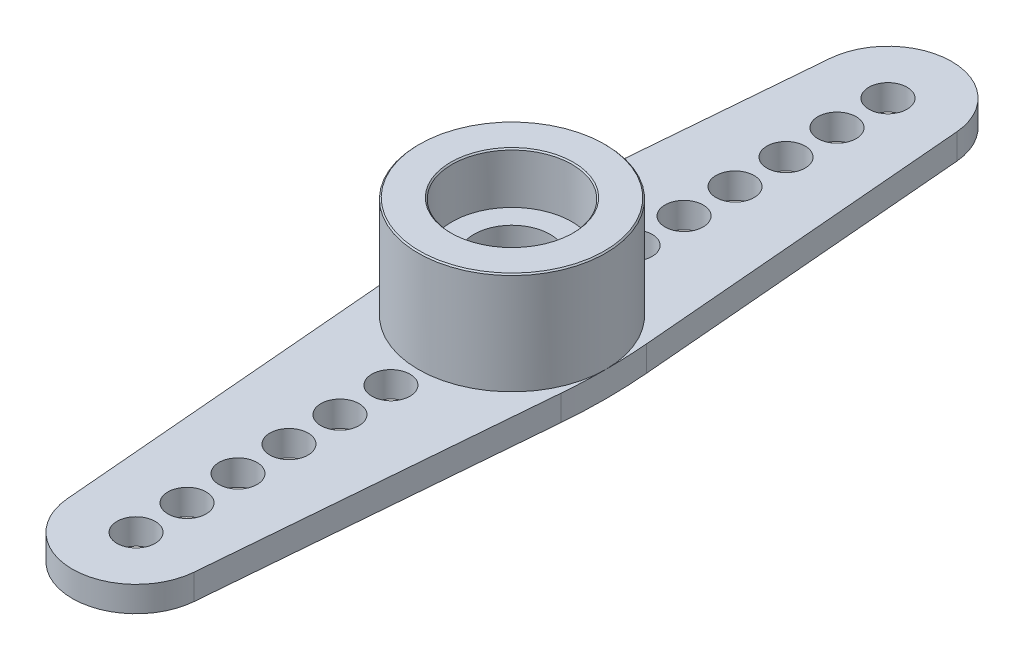
ISO-10303-21;
HEADER;
FILE_DESCRIPTION(('STEP AP214'),'2;1');
FILE_NAME('part.step','',(''),(''),'','','');
FILE_SCHEMA(('AUTOMOTIVE_DESIGN { 1 0 10303 214 1 1 1 1 }'));
ENDSEC;
DATA;
#1=APPLICATION_CONTEXT('core data for automotive mechanical design processes');
#2=APPLICATION_PROTOCOL_DEFINITION('international standard','automotive_design',2000,#1);
#3=PRODUCT_CONTEXT('',#1,'mechanical');
#4=PRODUCT('Part','Part','',(#3));
#5=PRODUCT_RELATED_PRODUCT_CATEGORY('part','',(#4));
#6=PRODUCT_DEFINITION_FORMATION('','',#4);
#7=PRODUCT_DEFINITION_CONTEXT('part definition',#1,'design');
#8=PRODUCT_DEFINITION('design','',#6,#7);
#9=PRODUCT_DEFINITION_SHAPE('','',#8);
#10=(LENGTH_UNIT() NAMED_UNIT(*) SI_UNIT(.MILLI.,.METRE.));
#11=(NAMED_UNIT(*) PLANE_ANGLE_UNIT() SI_UNIT($,.RADIAN.));
#12=(NAMED_UNIT(*) SI_UNIT($,.STERADIAN.) SOLID_ANGLE_UNIT());
#13=UNCERTAINTY_MEASURE_WITH_UNIT(LENGTH_MEASURE(1.E-05),#10,'distance_accuracy_value','');
#14=(GEOMETRIC_REPRESENTATION_CONTEXT(3) GLOBAL_UNCERTAINTY_ASSIGNED_CONTEXT((#13)) GLOBAL_UNIT_ASSIGNED_CONTEXT((#10,
#11,#12)) REPRESENTATION_CONTEXT('',''));
#15=CARTESIAN_POINT('',(0.,0.,0.));
#16=DIRECTION('',(0.,0.,1.));
#17=DIRECTION('',(1.,0.,0.));
#18=AXIS2_PLACEMENT_3D('',#15,#16,#17);
#19=CARTESIAN_POINT('',(0.,5.,0.));
#20=DIRECTION('',(0.,-1.,0.));
#21=DIRECTION('',(0.,0.,-1.));
#22=AXIS2_PLACEMENT_3D('',#19,#20,#21);
#23=CYLINDRICAL_SURFACE('',#22,1.5);
#24=CARTESIAN_POINT('',(0.,1.,0.));
#25=DIRECTION('',(0.,1.,0.));
#26=DIRECTION('',(0.,0.,1.));
#27=AXIS2_PLACEMENT_3D('',#24,#25,#26);
#28=CIRCLE('',#27,1.5);
#29=CARTESIAN_POINT('',(0.,1.,1.5));
#30=VERTEX_POINT('',#29);
#31=EDGE_CURVE('E350',#30,#30,#28,.T.);
#32=ORIENTED_EDGE('',*,*,#31,.F.);
#33=EDGE_LOOP('',(#32));
#34=FACE_BOUND('',#33,.T.);
#35=CARTESIAN_POINT('',(0.,3.,0.));
#36=DIRECTION('',(0.,1.,0.));
#37=DIRECTION('',(0.,0.,1.));
#38=AXIS2_PLACEMENT_3D('',#35,#36,#37);
#39=CIRCLE('',#38,1.5);
#40=CARTESIAN_POINT('',(0.,3.,1.5));
#41=VERTEX_POINT('',#40);
#42=EDGE_CURVE('E318',#41,#41,#39,.F.);
#43=ORIENTED_EDGE('',*,*,#42,.F.);
#44=EDGE_LOOP('',(#43));
#45=FACE_BOUND('',#44,.T.);
#46=ADVANCED_FACE('F48',(#34,#45),#23,.F.);
#47=CARTESIAN_POINT('',(0.,1.,0.));
#48=DIRECTION('',(0.,1.,0.));
#49=DIRECTION('',(0.,0.,1.));
#50=AXIS2_PLACEMENT_3D('',#47,#48,#49);
#51=PLANE('',#50);
#52=CARTESIAN_POINT('',(0.,1.,0.));
#53=DIRECTION('',(0.,1.,0.));
#54=DIRECTION('',(0.,0.,1.));
#55=AXIS2_PLACEMENT_3D('',#52,#53,#54);
#56=CIRCLE('',#55,3.67931811974818);
#57=CARTESIAN_POINT('',(3.67931811974816,1.,0.));
#58=VERTEX_POINT('',#57);
#59=CARTESIAN_POINT('',(-3.67931811974816,1.,0.));
#60=VERTEX_POINT('',#59);
#61=EDGE_CURVE('E222',#58,#60,#56,.T.);
#62=ORIENTED_EDGE('',*,*,#61,.F.);
#63=CARTESIAN_POINT('',(-16.3206818802518,1.,0.));
#64=DIRECTION('',(0.,1.,0.));
#65=DIRECTION('',(0.,0.,1.));
#66=AXIS2_PLACEMENT_3D('',#63,#64,#65);
#67=CIRCLE('',#66,20.);
#68=CARTESIAN_POINT('',(3.60888515621105,1.,-1.67700856859226));
#69=VERTEX_POINT('',#68);
#70=EDGE_CURVE('E366',#58,#69,#67,.T.);
#71=ORIENTED_EDGE('',*,*,#70,.T.);
#72=DIRECTION('',(0.083850428429611,0.,0.996478351823145));
#73=VECTOR('',#72,1.);
#74=CARTESIAN_POINT('',(3.72363414619564,1.,-0.313331762704512));
#75=LINE('',#74,#73);
#76=CARTESIAN_POINT('',(2.49119587955789,1.,-14.959626071074));
#77=VERTEX_POINT('',#76);
#78=EDGE_CURVE('E158',#77,#69,#75,.T.);
#79=ORIENTED_EDGE('',*,*,#78,.F.);
#80=CARTESIAN_POINT('',(0.,1.,-14.75));
#81=DIRECTION('',(0.,1.,0.));
#82=DIRECTION('',(0.,0.,1.));
#83=AXIS2_PLACEMENT_3D('',#80,#81,#82);
#84=CIRCLE('',#83,2.50000000000002);
#85=CARTESIAN_POINT('',(-2.49119587955786,1.,-14.959626071074));
#86=VERTEX_POINT('',#85);
#87=EDGE_CURVE('E134',#86,#77,#84,.F.);
#88=ORIENTED_EDGE('',*,*,#87,.F.);
#89=DIRECTION('',(-0.0838504284296129,0.,0.996478351823144));
#90=VECTOR('',#89,1.);
#91=CARTESIAN_POINT('',(-3.72363414619564,1.,-0.31333176270452));
#92=LINE('',#91,#90);
#93=CARTESIAN_POINT('',(-3.60888515621104,1.,-1.67700856859233));
#94=VERTEX_POINT('',#93);
#95=EDGE_CURVE('E146',#86,#94,#92,.T.);
#96=ORIENTED_EDGE('',*,*,#95,.T.);
#97=CARTESIAN_POINT('',(16.3206818802518,1.,0.));
#98=DIRECTION('',(0.,1.,0.));
#99=DIRECTION('',(0.,0.,1.));
#100=AXIS2_PLACEMENT_3D('',#97,#98,#99);
#101=CIRCLE('',#100,20.);
#102=EDGE_CURVE('E151',#60,#94,#101,.F.);
#103=ORIENTED_EDGE('',*,*,#102,.F.);
#104=EDGE_LOOP('',(#62,#71,#79,#88,#96,#103));
#105=FACE_BOUND('',#104,.T.);
#106=CARTESIAN_POINT('',(0.,1.,-14.75));
#107=DIRECTION('',(0.,1.,0.));
#108=DIRECTION('',(0.,0.,1.));
#109=AXIS2_PLACEMENT_3D('',#106,#107,#108);
#110=CIRCLE('',#109,0.75);
#111=CARTESIAN_POINT('',(0.,1.,-14.));
#112=VERTEX_POINT('',#111);
#113=EDGE_CURVE('E202',#112,#112,#110,.T.);
#114=ORIENTED_EDGE('',*,*,#113,.F.);
#115=EDGE_LOOP('',(#114));
#116=FACE_BOUND('',#115,.T.);
#117=CARTESIAN_POINT('',(0.,1.,-12.75));
#118=DIRECTION('',(0.,1.,0.));
#119=DIRECTION('',(0.,0.,1.));
#120=AXIS2_PLACEMENT_3D('',#117,#118,#119);
#121=CIRCLE('',#120,0.75);
#122=CARTESIAN_POINT('',(0.,1.,-12.));
#123=VERTEX_POINT('',#122);
#124=EDGE_CURVE('E198',#123,#123,#121,.T.);
#125=ORIENTED_EDGE('',*,*,#124,.F.);
#126=EDGE_LOOP('',(#125));
#127=FACE_BOUND('',#126,.T.);
#128=CARTESIAN_POINT('',(0.,1.,-10.75));
#129=DIRECTION('',(0.,1.,0.));
#130=DIRECTION('',(0.,0.,1.));
#131=AXIS2_PLACEMENT_3D('',#128,#129,#130);
#132=CIRCLE('',#131,0.75);
#133=CARTESIAN_POINT('',(0.,1.,-9.99999999999998));
#134=VERTEX_POINT('',#133);
#135=EDGE_CURVE('E194',#134,#134,#132,.T.);
#136=ORIENTED_EDGE('',*,*,#135,.F.);
#137=EDGE_LOOP('',(#136));
#138=FACE_BOUND('',#137,.T.);
#139=CARTESIAN_POINT('',(0.,1.,-8.74999999999998));
#140=DIRECTION('',(0.,1.,0.));
#141=DIRECTION('',(0.,0.,1.));
#142=AXIS2_PLACEMENT_3D('',#139,#140,#141);
#143=CIRCLE('',#142,0.75);
#144=CARTESIAN_POINT('',(0.,1.,-7.99999999999998));
#145=VERTEX_POINT('',#144);
#146=EDGE_CURVE('E190',#145,#145,#143,.T.);
#147=ORIENTED_EDGE('',*,*,#146,.F.);
#148=EDGE_LOOP('',(#147));
#149=FACE_BOUND('',#148,.T.);
#150=CARTESIAN_POINT('',(1.11016832917263E-13,1.,-6.74999999999998));
#151=DIRECTION('',(0.,1.,0.));
#152=DIRECTION('',(0.,0.,1.));
#153=AXIS2_PLACEMENT_3D('',#150,#151,#152);
#154=CIRCLE('',#153,0.75);
#155=CARTESIAN_POINT('',(1.11016832917263E-13,1.,-5.99999999999998));
#156=VERTEX_POINT('',#155);
#157=EDGE_CURVE('E187',#156,#156,#154,.T.);
#158=ORIENTED_EDGE('',*,*,#157,.F.);
#159=EDGE_LOOP('',(#158));
#160=FACE_BOUND('',#159,.T.);
#161=CARTESIAN_POINT('',(1.35518434629123E-13,1.,-4.74999999999998));
#162=DIRECTION('',(0.,1.,0.));
#163=DIRECTION('',(0.,0.,1.));
#164=AXIS2_PLACEMENT_3D('',#161,#162,#163);
#165=CIRCLE('',#164,0.75);
#166=CARTESIAN_POINT('',(1.35518434629123E-13,1.,-3.99999999999998));
#167=VERTEX_POINT('',#166);
#168=EDGE_CURVE('E183',#167,#167,#165,.T.);
#169=ORIENTED_EDGE('',*,*,#168,.F.);
#170=EDGE_LOOP('',(#169));
#171=FACE_BOUND('',#170,.T.);
#172=ADVANCED_FACE('F155',(#105,#116,#127,#138,#149,#160,#171),#51,.T.);
#173=CARTESIAN_POINT('',(0.,1.,0.));
#174=DIRECTION('',(0.,1.,0.));
#175=DIRECTION('',(0.,0.,1.));
#176=AXIS2_PLACEMENT_3D('',#173,#174,#175);
#177=CIRCLE('',#176,0.75);
#178=CARTESIAN_POINT('',(0.,1.,0.75));
#179=VERTEX_POINT('',#178);
#180=EDGE_CURVE('E317',#179,#179,#177,.F.);
#181=ORIENTED_EDGE('',*,*,#180,.T.);
#182=EDGE_LOOP('',(#181));
#183=FACE_BOUND('',#182,.T.);
#184=ORIENTED_EDGE('',*,*,#31,.T.);
#185=EDGE_LOOP('',(#184));
#186=FACE_BOUND('',#185,.T.);
#187=ADVANCED_FACE('F398',(#183,#186),#51,.T.);
#188=CARTESIAN_POINT('',(-3.72363414619564,1.,0.31333176270452));
#189=DIRECTION('',(0.996478351823144,0.,-0.0838504284296129));
#190=DIRECTION('',(-0.0838504284296129,0.,-0.996478351823144));
#191=AXIS2_PLACEMENT_3D('',#188,#189,#190);
#192=PLANE('',#191);
#193=DIRECTION('',(0.0838504284296129,0.,0.996478351823144));
#194=VECTOR('',#193,1.);
#195=CARTESIAN_POINT('',(-3.72363414619564,0.,0.31333176270452));
#196=LINE('',#195,#194);
#197=CARTESIAN_POINT('',(-3.60888515621104,0.,1.67700856859233));
#198=VERTEX_POINT('',#197);
#199=CARTESIAN_POINT('',(-2.49119587955786,0.,14.959626071074));
#200=VERTEX_POINT('',#199);
#201=EDGE_CURVE('E218',#198,#200,#196,.T.);
#202=ORIENTED_EDGE('',*,*,#201,.T.);
#203=DIRECTION('',(0.,-1.,0.));
#204=VECTOR('',#203,1.);
#205=CARTESIAN_POINT('',(-2.49119587955786,1.,14.959626071074));
#206=LINE('',#205,#204);
#207=CARTESIAN_POINT('',(-2.49119587955786,1.,14.959626071074));
#208=VERTEX_POINT('',#207);
#209=EDGE_CURVE('E309',#208,#200,#206,.T.);
#210=ORIENTED_EDGE('',*,*,#209,.F.);
#211=DIRECTION('',(0.0838504284296129,0.,0.996478351823144));
#212=VECTOR('',#211,1.);
#213=CARTESIAN_POINT('',(-3.72363414619564,1.,0.31333176270452));
#214=LINE('',#213,#212);
#215=CARTESIAN_POINT('',(-3.60888515621104,1.,1.67700856859233));
#216=VERTEX_POINT('',#215);
#217=EDGE_CURVE('E292',#216,#208,#214,.T.);
#218=ORIENTED_EDGE('',*,*,#217,.F.);
#219=DIRECTION('',(0.,-1.,0.));
#220=VECTOR('',#219,1.);
#221=CARTESIAN_POINT('',(-3.60888515621104,1.,1.67700856859233));
#222=LINE('',#221,#220);
#223=EDGE_CURVE('E73',#216,#198,#222,.T.);
#224=ORIENTED_EDGE('',*,*,#223,.T.);
#225=EDGE_LOOP('',(#202,#210,#218,#224));
#226=FACE_BOUND('',#225,.T.);
#227=ADVANCED_FACE('F499',(#226),#192,.F.);
#228=CARTESIAN_POINT('',(0.,1.,14.75));
#229=DIRECTION('',(0.,-1.,0.));
#230=DIRECTION('',(0.,0.,-1.));
#231=AXIS2_PLACEMENT_3D('',#228,#229,#230);
#232=CYLINDRICAL_SURFACE('',#231,2.5);
#233=CARTESIAN_POINT('',(0.,0.,14.75));
#234=DIRECTION('',(0.,1.,0.));
#235=DIRECTION('',(0.,0.,1.));
#236=AXIS2_PLACEMENT_3D('',#233,#234,#235);
#237=CIRCLE('',#236,2.5);
#238=CARTESIAN_POINT('',(2.49119587955786,0.,14.959626071074));
#239=VERTEX_POINT('',#238);
#240=EDGE_CURVE('E221',#200,#239,#237,.T.);
#241=ORIENTED_EDGE('',*,*,#240,.T.);
#242=DIRECTION('',(0.,-1.,0.));
#243=VECTOR('',#242,1.);
#244=CARTESIAN_POINT('',(2.49119587955786,1.,14.959626071074));
#245=LINE('',#244,#243);
#246=CARTESIAN_POINT('',(2.49119587955786,1.,14.959626071074));
#247=VERTEX_POINT('',#246);
#248=EDGE_CURVE('E306',#247,#239,#245,.T.);
#249=ORIENTED_EDGE('',*,*,#248,.F.);
#250=CARTESIAN_POINT('',(0.,1.,14.75));
#251=DIRECTION('',(0.,1.,0.));
#252=DIRECTION('',(0.,0.,1.));
#253=AXIS2_PLACEMENT_3D('',#250,#251,#252);
#254=CIRCLE('',#253,2.5);
#255=EDGE_CURVE('E113',#208,#247,#254,.T.);
#256=ORIENTED_EDGE('',*,*,#255,.F.);
#257=ORIENTED_EDGE('',*,*,#209,.T.);
#258=EDGE_LOOP('',(#241,#249,#256,#257));
#259=FACE_BOUND('',#258,.T.);
#260=ADVANCED_FACE('F495',(#259),#232,.T.);
#261=CARTESIAN_POINT('',(3.72363414619564,1.,0.313331762704518));
#262=DIRECTION('',(0.996478351823144,0.,0.0838504284296127));
#263=DIRECTION('',(0.0838504284296127,0.,-0.996478351823144));
#264=AXIS2_PLACEMENT_3D('',#261,#262,#263);
#265=PLANE('',#264);
#266=DIRECTION('',(-0.0838504284296127,0.,0.996478351823145));
#267=VECTOR('',#266,1.);
#268=CARTESIAN_POINT('',(3.72363414619564,0.,0.313331762704518));
#269=LINE('',#268,#267);
#270=CARTESIAN_POINT('',(3.60888515621105,0.,1.67700856859226));
#271=VERTEX_POINT('',#270);
#272=EDGE_CURVE('E226',#271,#239,#269,.T.);
#273=ORIENTED_EDGE('',*,*,#272,.F.);
#274=DIRECTION('',(0.,-1.,0.));
#275=VECTOR('',#274,1.);
#276=CARTESIAN_POINT('',(3.60888515621105,1.,1.67700856859226));
#277=LINE('',#276,#275);
#278=CARTESIAN_POINT('',(3.60888515621105,1.,1.67700856859226));
#279=VERTEX_POINT('',#278);
#280=EDGE_CURVE('E303',#279,#271,#277,.T.);
#281=ORIENTED_EDGE('',*,*,#280,.F.);
#282=DIRECTION('',(-0.0838504284296127,0.,0.996478351823145));
#283=VECTOR('',#282,1.);
#284=CARTESIAN_POINT('',(3.72363414619564,1.,0.313331762704518));
#285=LINE('',#284,#283);
#286=EDGE_CURVE('E363',#279,#247,#285,.T.);
#287=ORIENTED_EDGE('',*,*,#286,.T.);
#288=ORIENTED_EDGE('',*,*,#248,.T.);
#289=EDGE_LOOP('',(#273,#281,#287,#288));
#290=FACE_BOUND('',#289,.T.);
#291=ADVANCED_FACE('F492',(#290),#265,.T.);
#292=CARTESIAN_POINT('',(-16.3206818802518,1.,0.));
#293=DIRECTION('',(0.,-1.,0.));
#294=DIRECTION('',(0.,0.,-1.));
#295=AXIS2_PLACEMENT_3D('',#292,#293,#294);
#296=CYLINDRICAL_SURFACE('',#295,20.);
#297=ORIENTED_EDGE('',*,*,#70,.F.);
#298=EDGE_CURVE('E164',#279,#58,#67,.T.);
#299=ORIENTED_EDGE('',*,*,#298,.F.);
#300=ORIENTED_EDGE('',*,*,#280,.T.);
#301=CARTESIAN_POINT('',(-16.3206818802518,0.,0.));
#302=DIRECTION('',(0.,1.,0.));
#303=DIRECTION('',(0.,0.,1.));
#304=AXIS2_PLACEMENT_3D('',#301,#302,#303);
#305=CIRCLE('',#304,20.);
#306=CARTESIAN_POINT('',(3.60888515621105,0.,-1.67700856859226));
#307=VERTEX_POINT('',#306);
#308=EDGE_CURVE('E230',#271,#307,#305,.T.);
#309=ORIENTED_EDGE('',*,*,#308,.T.);
#310=DIRECTION('',(0.,-1.,0.));
#311=VECTOR('',#310,1.);
#312=CARTESIAN_POINT('',(3.60888515621105,1.,-1.67700856859226));
#313=LINE('',#312,#311);
#314=EDGE_CURVE('E299',#69,#307,#313,.T.);
#315=ORIENTED_EDGE('',*,*,#314,.F.);
#316=EDGE_LOOP('',(#297,#299,#300,#309,#315));
#317=FACE_BOUND('',#316,.T.);
#318=ADVANCED_FACE('F373',(#317),#296,.T.);
#319=CARTESIAN_POINT('',(3.72363414619564,1.,-0.313331762704512));
#320=DIRECTION('',(0.996478351823144,0.,-0.083850428429611));
#321=DIRECTION('',(-0.083850428429611,0.,-0.996478351823145));
#322=AXIS2_PLACEMENT_3D('',#319,#320,#321);
#323=PLANE('',#322);
#324=DIRECTION('',(0.083850428429611,0.,0.996478351823145));
#325=VECTOR('',#324,1.);
#326=CARTESIAN_POINT('',(3.72363414619564,0.,-0.313331762704512));
#327=LINE('',#326,#325);
#328=CARTESIAN_POINT('',(2.49119587955789,0.,-14.959626071074));
#329=VERTEX_POINT('',#328);
#330=EDGE_CURVE('E233',#329,#307,#327,.T.);
#331=ORIENTED_EDGE('',*,*,#330,.F.);
#332=DIRECTION('',(0.,-1.,0.));
#333=VECTOR('',#332,1.);
#334=CARTESIAN_POINT('',(2.49119587955789,1.,-14.959626071074));
#335=LINE('',#334,#333);
#336=EDGE_CURVE('E141',#77,#329,#335,.T.);
#337=ORIENTED_EDGE('',*,*,#336,.F.);
#338=ORIENTED_EDGE('',*,*,#78,.T.);
#339=ORIENTED_EDGE('',*,*,#314,.T.);
#340=EDGE_LOOP('',(#331,#337,#338,#339));
#341=FACE_BOUND('',#340,.T.);
#342=ADVANCED_FACE('F377',(#341),#323,.T.);
#343=CARTESIAN_POINT('',(0.,1.,-14.75));
#344=DIRECTION('',(0.,-1.,0.));
#345=DIRECTION('',(0.,0.,-1.));
#346=AXIS2_PLACEMENT_3D('',#343,#344,#345);
#347=CYLINDRICAL_SURFACE('',#346,2.50000000000002);
#348=CARTESIAN_POINT('',(0.,0.,-14.75));
#349=DIRECTION('',(0.,1.,0.));
#350=DIRECTION('',(0.,0.,1.));
#351=AXIS2_PLACEMENT_3D('',#348,#349,#350);
#352=CIRCLE('',#351,2.50000000000002);
#353=CARTESIAN_POINT('',(-2.49119587955786,0.,-14.959626071074));
#354=VERTEX_POINT('',#353);
#355=EDGE_CURVE('E136',#354,#329,#352,.F.);
#356=ORIENTED_EDGE('',*,*,#355,.F.);
#357=DIRECTION('',(0.,-1.,0.));
#358=VECTOR('',#357,1.);
#359=CARTESIAN_POINT('',(-2.49119587955786,1.,-14.959626071074));
#360=LINE('',#359,#358);
#361=EDGE_CURVE('E130',#86,#354,#360,.T.);
#362=ORIENTED_EDGE('',*,*,#361,.F.);
#363=ORIENTED_EDGE('',*,*,#87,.T.);
#364=ORIENTED_EDGE('',*,*,#336,.T.);
#365=EDGE_LOOP('',(#356,#362,#363,#364));
#366=FACE_BOUND('',#365,.T.);
#367=ADVANCED_FACE('F132',(#366),#347,.T.);
#368=CARTESIAN_POINT('',(-3.72363414619564,1.,-0.31333176270452));
#369=DIRECTION('',(0.996478351823144,0.,0.0838504284296129));
#370=DIRECTION('',(0.0838504284296129,0.,-0.996478351823144));
#371=AXIS2_PLACEMENT_3D('',#368,#369,#370);
#372=PLANE('',#371);
#373=DIRECTION('',(-0.0838504284296129,0.,0.996478351823144));
#374=VECTOR('',#373,1.);
#375=CARTESIAN_POINT('',(-3.72363414619564,0.,-0.31333176270452));
#376=LINE('',#375,#374);
#377=CARTESIAN_POINT('',(-3.60888515621104,0.,-1.67700856859233));
#378=VERTEX_POINT('',#377);
#379=EDGE_CURVE('E239',#354,#378,#376,.T.);
#380=ORIENTED_EDGE('',*,*,#379,.T.);
#381=DIRECTION('',(0.,-1.,0.));
#382=VECTOR('',#381,1.);
#383=CARTESIAN_POINT('',(-3.60888515621104,1.,-1.67700856859233));
#384=LINE('',#383,#382);
#385=EDGE_CURVE('E142',#94,#378,#384,.T.);
#386=ORIENTED_EDGE('',*,*,#385,.F.);
#387=ORIENTED_EDGE('',*,*,#95,.F.);
#388=ORIENTED_EDGE('',*,*,#361,.T.);
#389=EDGE_LOOP('',(#380,#386,#387,#388));
#390=FACE_BOUND('',#389,.T.);
#391=ADVANCED_FACE('F147',(#390),#372,.F.);
#392=CARTESIAN_POINT('',(0.,1.,10.75));
#393=DIRECTION('',(0.,-1.,0.));
#394=DIRECTION('',(0.,0.,-1.));
#395=AXIS2_PLACEMENT_3D('',#392,#393,#394);
#396=CYLINDRICAL_SURFACE('',#395,0.75);
#397=CARTESIAN_POINT('',(0.,1.,10.75));
#398=DIRECTION('',(0.,1.,0.));
#399=DIRECTION('',(0.,0.,1.));
#400=AXIS2_PLACEMENT_3D('',#397,#398,#399);
#401=CIRCLE('',#400,0.75);
#402=CARTESIAN_POINT('',(0.,1.,11.5));
#403=VERTEX_POINT('',#402);
#404=EDGE_CURVE('E210',#403,#403,#401,.F.);
#405=ORIENTED_EDGE('',*,*,#404,.F.);
#406=EDGE_LOOP('',(#405));
#407=FACE_BOUND('',#406,.T.);
#408=CARTESIAN_POINT('',(0.,0.,10.75));
#409=DIRECTION('',(0.,1.,0.));
#410=DIRECTION('',(0.,0.,1.));
#411=AXIS2_PLACEMENT_3D('',#408,#409,#410);
#412=CIRCLE('',#411,0.75);
#413=CARTESIAN_POINT('',(0.,0.,11.5));
#414=VERTEX_POINT('',#413);
#415=EDGE_CURVE('E284',#414,#414,#412,.F.);
#416=ORIENTED_EDGE('',*,*,#415,.T.);
#417=EDGE_LOOP('',(#416));
#418=FACE_BOUND('',#417,.T.);
#419=ADVANCED_FACE('F438',(#407,#418),#396,.F.);
#420=CARTESIAN_POINT('',(1.11016832917263E-13,1.,6.74999999999998));
#421=DIRECTION('',(0.,-1.,0.));
#422=DIRECTION('',(0.,0.,-1.));
#423=AXIS2_PLACEMENT_3D('',#420,#421,#422);
#424=CYLINDRICAL_SURFACE('',#423,0.75);
#425=CARTESIAN_POINT('',(1.11016832917263E-13,1.,6.74999999999998));
#426=DIRECTION('',(0.,1.,0.));
#427=DIRECTION('',(0.,0.,1.));
#428=AXIS2_PLACEMENT_3D('',#425,#426,#427);
#429=CIRCLE('',#428,0.75);
#430=CARTESIAN_POINT('',(1.11016832917263E-13,1.,7.49999999999998));
#431=VERTEX_POINT('',#430);
#432=EDGE_CURVE('E206',#431,#431,#429,.F.);
#433=ORIENTED_EDGE('',*,*,#432,.F.);
#434=EDGE_LOOP('',(#433));
#435=FACE_BOUND('',#434,.T.);
#436=CARTESIAN_POINT('',(1.11016832917263E-13,0.,6.74999999999998));
#437=DIRECTION('',(0.,1.,0.));
#438=DIRECTION('',(0.,0.,1.));
#439=AXIS2_PLACEMENT_3D('',#436,#437,#438);
#440=CIRCLE('',#439,0.75);
#441=CARTESIAN_POINT('',(1.11016832917263E-13,0.,7.49999999999998));
#442=VERTEX_POINT('',#441);
#443=EDGE_CURVE('E280',#442,#442,#440,.F.);
#444=ORIENTED_EDGE('',*,*,#443,.T.);
#445=EDGE_LOOP('',(#444));
#446=FACE_BOUND('',#445,.T.);
#447=ADVANCED_FACE('F441',(#435,#446),#424,.F.);
#448=CARTESIAN_POINT('',(0.,1.,-14.75));
#449=DIRECTION('',(0.,-1.,0.));
#450=DIRECTION('',(0.,0.,-1.));
#451=AXIS2_PLACEMENT_3D('',#448,#449,#450);
#452=CYLINDRICAL_SURFACE('',#451,0.75);
#453=ORIENTED_EDGE('',*,*,#113,.T.);
#454=EDGE_LOOP('',(#453));
#455=FACE_BOUND('',#454,.T.);
#456=CARTESIAN_POINT('',(0.,0.,-14.75));
#457=DIRECTION('',(0.,1.,0.));
#458=DIRECTION('',(0.,0.,1.));
#459=AXIS2_PLACEMENT_3D('',#456,#457,#458);
#460=CIRCLE('',#459,0.75);
#461=CARTESIAN_POINT('',(0.,0.,-14.));
#462=VERTEX_POINT('',#461);
#463=EDGE_CURVE('E276',#462,#462,#460,.T.);
#464=ORIENTED_EDGE('',*,*,#463,.F.);
#465=EDGE_LOOP('',(#464));
#466=FACE_BOUND('',#465,.T.);
#467=ADVANCED_FACE('F445',(#455,#466),#452,.F.);
#468=CARTESIAN_POINT('',(0.,1.,-12.75));
#469=DIRECTION('',(0.,-1.,0.));
#470=DIRECTION('',(0.,0.,-1.));
#471=AXIS2_PLACEMENT_3D('',#468,#469,#470);
#472=CYLINDRICAL_SURFACE('',#471,0.75);
#473=ORIENTED_EDGE('',*,*,#124,.T.);
#474=EDGE_LOOP('',(#473));
#475=FACE_BOUND('',#474,.T.);
#476=CARTESIAN_POINT('',(0.,0.,-12.75));
#477=DIRECTION('',(0.,1.,0.));
#478=DIRECTION('',(0.,0.,1.));
#479=AXIS2_PLACEMENT_3D('',#476,#477,#478);
#480=CIRCLE('',#479,0.75);
#481=CARTESIAN_POINT('',(0.,0.,-12.));
#482=VERTEX_POINT('',#481);
#483=EDGE_CURVE('E272',#482,#482,#480,.T.);
#484=ORIENTED_EDGE('',*,*,#483,.F.);
#485=EDGE_LOOP('',(#484));
#486=FACE_BOUND('',#485,.T.);
#487=ADVANCED_FACE('F449',(#475,#486),#472,.F.);
#488=CARTESIAN_POINT('',(0.,1.,-10.75));
#489=DIRECTION('',(0.,-1.,0.));
#490=DIRECTION('',(0.,0.,-1.));
#491=AXIS2_PLACEMENT_3D('',#488,#489,#490);
#492=CYLINDRICAL_SURFACE('',#491,0.75);
#493=ORIENTED_EDGE('',*,*,#135,.T.);
#494=EDGE_LOOP('',(#493));
#495=FACE_BOUND('',#494,.T.);
#496=CARTESIAN_POINT('',(0.,0.,-10.75));
#497=DIRECTION('',(0.,1.,0.));
#498=DIRECTION('',(0.,0.,1.));
#499=AXIS2_PLACEMENT_3D('',#496,#497,#498);
#500=CIRCLE('',#499,0.75);
#501=CARTESIAN_POINT('',(0.,0.,-9.99999999999998));
#502=VERTEX_POINT('',#501);
#503=EDGE_CURVE('E268',#502,#502,#500,.T.);
#504=ORIENTED_EDGE('',*,*,#503,.F.);
#505=EDGE_LOOP('',(#504));
#506=FACE_BOUND('',#505,.T.);
#507=ADVANCED_FACE('F453',(#495,#506),#492,.F.);
#508=CARTESIAN_POINT('',(0.,1.,-8.74999999999998));
#509=DIRECTION('',(0.,-1.,0.));
#510=DIRECTION('',(0.,0.,-1.));
#511=AXIS2_PLACEMENT_3D('',#508,#509,#510);
#512=CYLINDRICAL_SURFACE('',#511,0.75);
#513=ORIENTED_EDGE('',*,*,#146,.T.);
#514=EDGE_LOOP('',(#513));
#515=FACE_BOUND('',#514,.T.);
#516=CARTESIAN_POINT('',(0.,0.,-8.74999999999998));
#517=DIRECTION('',(0.,1.,0.));
#518=DIRECTION('',(0.,0.,1.));
#519=AXIS2_PLACEMENT_3D('',#516,#517,#518);
#520=CIRCLE('',#519,0.75);
#521=CARTESIAN_POINT('',(0.,0.,-7.99999999999998));
#522=VERTEX_POINT('',#521);
#523=EDGE_CURVE('E264',#522,#522,#520,.T.);
#524=ORIENTED_EDGE('',*,*,#523,.F.);
#525=EDGE_LOOP('',(#524));
#526=FACE_BOUND('',#525,.T.);
#527=ADVANCED_FACE('F457',(#515,#526),#512,.F.);
#528=CARTESIAN_POINT('',(1.11016832917263E-13,1.,-6.74999999999998));
#529=DIRECTION('',(0.,-1.,0.));
#530=DIRECTION('',(0.,0.,-1.));
#531=AXIS2_PLACEMENT_3D('',#528,#529,#530);
#532=CYLINDRICAL_SURFACE('',#531,0.75);
#533=ORIENTED_EDGE('',*,*,#157,.T.);
#534=EDGE_LOOP('',(#533));
#535=FACE_BOUND('',#534,.T.);
#536=CARTESIAN_POINT('',(1.11016832917263E-13,0.,-6.74999999999998));
#537=DIRECTION('',(0.,1.,0.));
#538=DIRECTION('',(0.,0.,1.));
#539=AXIS2_PLACEMENT_3D('',#536,#537,#538);
#540=CIRCLE('',#539,0.75);
#541=CARTESIAN_POINT('',(1.11016832917263E-13,0.,-5.99999999999998));
#542=VERTEX_POINT('',#541);
#543=EDGE_CURVE('E260',#542,#542,#540,.T.);
#544=ORIENTED_EDGE('',*,*,#543,.F.);
#545=EDGE_LOOP('',(#544));
#546=FACE_BOUND('',#545,.T.);
#547=ADVANCED_FACE('F461',(#535,#546),#532,.F.);
#548=CARTESIAN_POINT('',(1.35518434629123E-13,1.,-4.74999999999998));
#549=DIRECTION('',(0.,-1.,0.));
#550=DIRECTION('',(0.,0.,-1.));
#551=AXIS2_PLACEMENT_3D('',#548,#549,#550);
#552=CYLINDRICAL_SURFACE('',#551,0.75);
#553=ORIENTED_EDGE('',*,*,#168,.T.);
#554=EDGE_LOOP('',(#553));
#555=FACE_BOUND('',#554,.T.);
#556=CARTESIAN_POINT('',(1.35518434629123E-13,0.,-4.74999999999998));
#557=DIRECTION('',(0.,1.,0.));
#558=DIRECTION('',(0.,0.,1.));
#559=AXIS2_PLACEMENT_3D('',#556,#557,#558);
#560=CIRCLE('',#559,0.75);
#561=CARTESIAN_POINT('',(1.35518434629123E-13,0.,-3.99999999999998));
#562=VERTEX_POINT('',#561);
#563=EDGE_CURVE('E256',#562,#562,#560,.T.);
#564=ORIENTED_EDGE('',*,*,#563,.F.);
#565=EDGE_LOOP('',(#564));
#566=FACE_BOUND('',#565,.T.);
#567=ADVANCED_FACE('F465',(#555,#566),#552,.F.);
#568=CARTESIAN_POINT('',(1.35518434629123E-13,1.,4.74999999999998));
#569=DIRECTION('',(0.,-1.,0.));
#570=DIRECTION('',(0.,0.,-1.));
#571=AXIS2_PLACEMENT_3D('',#568,#569,#570);
#572=CYLINDRICAL_SURFACE('',#571,0.75);
#573=CARTESIAN_POINT('',(1.35518434629123E-13,1.,4.74999999999998));
#574=DIRECTION('',(0.,1.,0.));
#575=DIRECTION('',(0.,0.,1.));
#576=AXIS2_PLACEMENT_3D('',#573,#574,#575);
#577=CIRCLE('',#576,0.75);
#578=CARTESIAN_POINT('',(1.35518434629123E-13,1.,5.49999999999998));
#579=VERTEX_POINT('',#578);
#580=EDGE_CURVE('E179',#579,#579,#577,.F.);
#581=ORIENTED_EDGE('',*,*,#580,.F.);
#582=EDGE_LOOP('',(#581));
#583=FACE_BOUND('',#582,.T.);
#584=CARTESIAN_POINT('',(1.35518434629123E-13,0.,4.74999999999998));
#585=DIRECTION('',(0.,1.,0.));
#586=DIRECTION('',(0.,0.,1.));
#587=AXIS2_PLACEMENT_3D('',#584,#585,#586);
#588=CIRCLE('',#587,0.75);
#589=CARTESIAN_POINT('',(1.35518434629123E-13,0.,5.49999999999998));
#590=VERTEX_POINT('',#589);
#591=EDGE_CURVE('E252',#590,#590,#588,.F.);
#592=ORIENTED_EDGE('',*,*,#591,.T.);
#593=EDGE_LOOP('',(#592));
#594=FACE_BOUND('',#593,.T.);
#595=ADVANCED_FACE('F469',(#583,#594),#572,.F.);
#596=CARTESIAN_POINT('',(0.,1.,8.74999999999998));
#597=DIRECTION('',(0.,-1.,0.));
#598=DIRECTION('',(0.,0.,-1.));
#599=AXIS2_PLACEMENT_3D('',#596,#597,#598);
#600=CYLINDRICAL_SURFACE('',#599,0.75);
#601=CARTESIAN_POINT('',(0.,1.,8.74999999999998));
#602=DIRECTION('',(0.,1.,0.));
#603=DIRECTION('',(0.,0.,1.));
#604=AXIS2_PLACEMENT_3D('',#601,#602,#603);
#605=CIRCLE('',#604,0.75);
#606=CARTESIAN_POINT('',(0.,1.,9.49999999999998));
#607=VERTEX_POINT('',#606);
#608=EDGE_CURVE('E175',#607,#607,#605,.F.);
#609=ORIENTED_EDGE('',*,*,#608,.F.);
#610=EDGE_LOOP('',(#609));
#611=FACE_BOUND('',#610,.T.);
#612=CARTESIAN_POINT('',(0.,0.,8.74999999999998));
#613=DIRECTION('',(0.,1.,0.));
#614=DIRECTION('',(0.,0.,1.));
#615=AXIS2_PLACEMENT_3D('',#612,#613,#614);
#616=CIRCLE('',#615,0.75);
#617=CARTESIAN_POINT('',(0.,0.,9.49999999999998));
#618=VERTEX_POINT('',#617);
#619=EDGE_CURVE('E248',#618,#618,#616,.F.);
#620=ORIENTED_EDGE('',*,*,#619,.T.);
#621=EDGE_LOOP('',(#620));
#622=FACE_BOUND('',#621,.T.);
#623=ADVANCED_FACE('F473',(#611,#622),#600,.F.);
#624=CARTESIAN_POINT('',(0.,1.,12.75));
#625=DIRECTION('',(0.,-1.,0.));
#626=DIRECTION('',(0.,0.,-1.));
#627=AXIS2_PLACEMENT_3D('',#624,#625,#626);
#628=CYLINDRICAL_SURFACE('',#627,0.75);
#629=CARTESIAN_POINT('',(0.,1.,12.75));
#630=DIRECTION('',(0.,1.,0.));
#631=DIRECTION('',(0.,0.,1.));
#632=AXIS2_PLACEMENT_3D('',#629,#630,#631);
#633=CIRCLE('',#632,0.75);
#634=CARTESIAN_POINT('',(0.,1.,13.5));
#635=VERTEX_POINT('',#634);
#636=EDGE_CURVE('E171',#635,#635,#633,.F.);
#637=ORIENTED_EDGE('',*,*,#636,.F.);
#638=EDGE_LOOP('',(#637));
#639=FACE_BOUND('',#638,.T.);
#640=CARTESIAN_POINT('',(0.,0.,12.75));
#641=DIRECTION('',(0.,1.,0.));
#642=DIRECTION('',(0.,0.,1.));
#643=AXIS2_PLACEMENT_3D('',#640,#641,#642);
#644=CIRCLE('',#643,0.75);
#645=CARTESIAN_POINT('',(0.,0.,13.5));
#646=VERTEX_POINT('',#645);
#647=EDGE_CURVE('E245',#646,#646,#644,.F.);
#648=ORIENTED_EDGE('',*,*,#647,.T.);
#649=EDGE_LOOP('',(#648));
#650=FACE_BOUND('',#649,.T.);
#651=ADVANCED_FACE('F477',(#639,#650),#628,.F.);
#652=CARTESIAN_POINT('',(16.3206818802518,1.,0.));
#653=DIRECTION('',(0.,-1.,0.));
#654=DIRECTION('',(0.,0.,-1.));
#655=AXIS2_PLACEMENT_3D('',#652,#653,#654);
#656=CYLINDRICAL_SURFACE('',#655,20.);
#657=ORIENTED_EDGE('',*,*,#385,.T.);
#658=CARTESIAN_POINT('',(16.3206818802518,0.,0.));
#659=DIRECTION('',(0.,1.,0.));
#660=DIRECTION('',(0.,0.,1.));
#661=AXIS2_PLACEMENT_3D('',#658,#659,#660);
#662=CIRCLE('',#661,20.);
#663=EDGE_CURVE('E242',#198,#378,#662,.F.);
#664=ORIENTED_EDGE('',*,*,#663,.F.);
#665=ORIENTED_EDGE('',*,*,#223,.F.);
#666=EDGE_CURVE('E168',#216,#60,#101,.F.);
#667=ORIENTED_EDGE('',*,*,#666,.T.);
#668=ORIENTED_EDGE('',*,*,#102,.T.);
#669=EDGE_LOOP('',(#657,#664,#665,#667,#668));
#670=FACE_BOUND('',#669,.T.);
#671=ADVANCED_FACE('F380',(#670),#656,.T.);
#672=CARTESIAN_POINT('',(0.,1.,14.75));
#673=DIRECTION('',(0.,-1.,0.));
#674=DIRECTION('',(0.,0.,-1.));
#675=AXIS2_PLACEMENT_3D('',#672,#673,#674);
#676=CYLINDRICAL_SURFACE('',#675,0.750000000000004);
#677=CARTESIAN_POINT('',(0.,1.,14.75));
#678=DIRECTION('',(0.,1.,0.));
#679=DIRECTION('',(0.,0.,1.));
#680=AXIS2_PLACEMENT_3D('',#677,#678,#679);
#681=CIRCLE('',#680,0.750000000000004);
#682=CARTESIAN_POINT('',(0.,1.,15.5));
#683=VERTEX_POINT('',#682);
#684=EDGE_CURVE('E214',#683,#683,#681,.F.);
#685=ORIENTED_EDGE('',*,*,#684,.F.);
#686=EDGE_LOOP('',(#685));
#687=FACE_BOUND('',#686,.T.);
#688=CARTESIAN_POINT('',(0.,0.,14.75));
#689=DIRECTION('',(0.,1.,0.));
#690=DIRECTION('',(0.,0.,1.));
#691=AXIS2_PLACEMENT_3D('',#688,#689,#690);
#692=CIRCLE('',#691,0.750000000000004);
#693=CARTESIAN_POINT('',(0.,0.,15.5));
#694=VERTEX_POINT('',#693);
#695=EDGE_CURVE('E288',#694,#694,#692,.F.);
#696=ORIENTED_EDGE('',*,*,#695,.T.);
#697=EDGE_LOOP('',(#696));
#698=FACE_BOUND('',#697,.T.);
#699=ADVANCED_FACE('F431',(#687,#698),#676,.F.);
#700=EDGE_CURVE('E64',#60,#58,#56,.T.);
#701=ORIENTED_EDGE('',*,*,#700,.F.);
#702=ORIENTED_EDGE('',*,*,#666,.F.);
#703=ORIENTED_EDGE('',*,*,#217,.T.);
#704=ORIENTED_EDGE('',*,*,#255,.T.);
#705=ORIENTED_EDGE('',*,*,#286,.F.);
#706=ORIENTED_EDGE('',*,*,#298,.T.);
#707=EDGE_LOOP('',(#701,#702,#703,#704,#705,#706));
#708=FACE_BOUND('',#707,.T.);
#709=ORIENTED_EDGE('',*,*,#636,.T.);
#710=EDGE_LOOP('',(#709));
#711=FACE_BOUND('',#710,.T.);
#712=ORIENTED_EDGE('',*,*,#608,.T.);
#713=EDGE_LOOP('',(#712));
#714=FACE_BOUND('',#713,.T.);
#715=ORIENTED_EDGE('',*,*,#580,.T.);
#716=EDGE_LOOP('',(#715));
#717=FACE_BOUND('',#716,.T.);
#718=ORIENTED_EDGE('',*,*,#432,.T.);
#719=EDGE_LOOP('',(#718));
#720=FACE_BOUND('',#719,.T.);
#721=ORIENTED_EDGE('',*,*,#404,.T.);
#722=EDGE_LOOP('',(#721));
#723=FACE_BOUND('',#722,.T.);
#724=ORIENTED_EDGE('',*,*,#684,.T.);
#725=EDGE_LOOP('',(#724));
#726=FACE_BOUND('',#725,.T.);
#727=ADVANCED_FACE('F424',(#708,#711,#714,#717,#720,#723,#726),#51,.T.);
#728=CARTESIAN_POINT('',(0.,0.,0.));
#729=DIRECTION('',(0.,1.,0.));
#730=DIRECTION('',(0.,0.,1.));
#731=AXIS2_PLACEMENT_3D('',#728,#729,#730);
#732=PLANE('',#731);
#733=CARTESIAN_POINT('',(0.,0.,0.));
#734=DIRECTION('',(0.,-1.,0.));
#735=DIRECTION('',(0.,0.,-1.));
#736=AXIS2_PLACEMENT_3D('',#733,#734,#735);
#737=CIRCLE('',#736,1.5);
#738=CARTESIAN_POINT('',(0.,0.,-1.5));
#739=VERTEX_POINT('',#738);
#740=EDGE_CURVE('E387',#739,#739,#737,.T.);
#741=ORIENTED_EDGE('',*,*,#740,.F.);
#742=EDGE_LOOP('',(#741));
#743=FACE_BOUND('',#742,.T.);
#744=ORIENTED_EDGE('',*,*,#663,.T.);
#745=ORIENTED_EDGE('',*,*,#379,.F.);
#746=ORIENTED_EDGE('',*,*,#355,.T.);
#747=ORIENTED_EDGE('',*,*,#330,.T.);
#748=ORIENTED_EDGE('',*,*,#308,.F.);
#749=ORIENTED_EDGE('',*,*,#272,.T.);
#750=ORIENTED_EDGE('',*,*,#240,.F.);
#751=ORIENTED_EDGE('',*,*,#201,.F.);
#752=EDGE_LOOP('',(#744,#745,#746,#747,#748,#749,#750,#751));
#753=FACE_BOUND('',#752,.T.);
#754=ORIENTED_EDGE('',*,*,#647,.F.);
#755=EDGE_LOOP('',(#754));
#756=FACE_BOUND('',#755,.T.);
#757=ORIENTED_EDGE('',*,*,#619,.F.);
#758=EDGE_LOOP('',(#757));
#759=FACE_BOUND('',#758,.T.);
#760=ORIENTED_EDGE('',*,*,#591,.F.);
#761=EDGE_LOOP('',(#760));
#762=FACE_BOUND('',#761,.T.);
#763=ORIENTED_EDGE('',*,*,#443,.F.);
#764=EDGE_LOOP('',(#763));
#765=FACE_BOUND('',#764,.T.);
#766=ORIENTED_EDGE('',*,*,#415,.F.);
#767=EDGE_LOOP('',(#766));
#768=FACE_BOUND('',#767,.T.);
#769=ORIENTED_EDGE('',*,*,#695,.F.);
#770=EDGE_LOOP('',(#769));
#771=FACE_BOUND('',#770,.T.);
#772=ORIENTED_EDGE('',*,*,#463,.T.);
#773=EDGE_LOOP('',(#772));
#774=FACE_BOUND('',#773,.T.);
#775=ORIENTED_EDGE('',*,*,#483,.T.);
#776=EDGE_LOOP('',(#775));
#777=FACE_BOUND('',#776,.T.);
#778=ORIENTED_EDGE('',*,*,#503,.T.);
#779=EDGE_LOOP('',(#778));
#780=FACE_BOUND('',#779,.T.);
#781=ORIENTED_EDGE('',*,*,#523,.T.);
#782=EDGE_LOOP('',(#781));
#783=FACE_BOUND('',#782,.T.);
#784=ORIENTED_EDGE('',*,*,#543,.T.);
#785=EDGE_LOOP('',(#784));
#786=FACE_BOUND('',#785,.T.);
#787=ORIENTED_EDGE('',*,*,#563,.T.);
#788=EDGE_LOOP('',(#787));
#789=FACE_BOUND('',#788,.T.);
#790=ADVANCED_FACE('F346',(#743,#753,#756,#759,#762,#765,#768,#771,#774,#777,#780,#783,#786,
#789),#732,.F.);
#791=CARTESIAN_POINT('',(0.,5.,0.));
#792=DIRECTION('',(0.,-1.,0.));
#793=DIRECTION('',(0.,0.,-1.));
#794=AXIS2_PLACEMENT_3D('',#791,#792,#793);
#795=CYLINDRICAL_SURFACE('',#794,3.67931811974818);
#796=CARTESIAN_POINT('',(0.,4.95,0.));
#797=DIRECTION('',(0.,-1.,0.));
#798=DIRECTION('',(0.,0.,-1.));
#799=AXIS2_PLACEMENT_3D('',#796,#797,#798);
#800=CIRCLE('',#799,3.67931811974818);
#801=CARTESIAN_POINT('',(0.,4.95,-3.67931811974818));
#802=VERTEX_POINT('',#801);
#803=EDGE_CURVE('E312',#802,#802,#800,.T.);
#804=ORIENTED_EDGE('',*,*,#803,.T.);
#805=EDGE_LOOP('',(#804));
#806=FACE_BOUND('',#805,.T.);
#807=ORIENTED_EDGE('',*,*,#700,.T.);
#808=ORIENTED_EDGE('',*,*,#61,.T.);
#809=EDGE_LOOP('',(#807,#808));
#810=FACE_BOUND('',#809,.T.);
#811=ADVANCED_FACE('F343',(#806,#810),#795,.T.);
#812=CARTESIAN_POINT('',(0.,5.,0.));
#813=DIRECTION('',(0.,-1.,0.));
#814=DIRECTION('',(0.,0.,-1.));
#815=AXIS2_PLACEMENT_3D('',#812,#813,#814);
#816=PLANE('',#815);
#817=CARTESIAN_POINT('',(0.,5.,0.));
#818=DIRECTION('',(0.,-1.,0.));
#819=DIRECTION('',(0.,0.,-1.));
#820=AXIS2_PLACEMENT_3D('',#817,#818,#819);
#821=CIRCLE('',#820,3.62931811974818);
#822=CARTESIAN_POINT('',(0.,5.,-3.62931811974818));
#823=VERTEX_POINT('',#822);
#824=EDGE_CURVE('E57',#823,#823,#821,.F.);
#825=ORIENTED_EDGE('',*,*,#824,.T.);
#826=EDGE_LOOP('',(#825));
#827=FACE_BOUND('',#826,.T.);
#828=CARTESIAN_POINT('',(0.,5.,0.));
#829=DIRECTION('',(0.,-1.,0.));
#830=DIRECTION('',(0.,0.,-1.));
#831=AXIS2_PLACEMENT_3D('',#828,#829,#830);
#832=CIRCLE('',#831,2.40500000000001);
#833=CARTESIAN_POINT('',(0.,5.,-2.40500000000001));
#834=VERTEX_POINT('',#833);
#835=EDGE_CURVE('E326',#834,#834,#832,.T.);
#836=ORIENTED_EDGE('',*,*,#835,.T.);
#837=EDGE_LOOP('',(#836));
#838=FACE_BOUND('',#837,.T.);
#839=ADVANCED_FACE('F334',(#827,#838),#816,.F.);
#840=CARTESIAN_POINT('',(0.,0.5,0.));
#841=DIRECTION('',(0.,-1.,0.));
#842=DIRECTION('',(0.,0.,-1.));
#843=AXIS2_PLACEMENT_3D('',#840,#841,#842);
#844=CYLINDRICAL_SURFACE('',#843,1.5);
#845=CARTESIAN_POINT('',(0.,0.5,0.));
#846=DIRECTION('',(0.,-1.,0.));
#847=DIRECTION('',(0.,0.,-1.));
#848=AXIS2_PLACEMENT_3D('',#845,#846,#847);
#849=CIRCLE('',#848,1.5);
#850=CARTESIAN_POINT('',(0.,0.5,-1.5));
#851=VERTEX_POINT('',#850);
#852=EDGE_CURVE('E355',#851,#851,#849,.T.);
#853=ORIENTED_EDGE('',*,*,#852,.F.);
#854=EDGE_LOOP('',(#853));
#855=FACE_BOUND('',#854,.T.);
#856=ORIENTED_EDGE('',*,*,#740,.T.);
#857=EDGE_LOOP('',(#856));
#858=FACE_BOUND('',#857,.T.);
#859=ADVANCED_FACE('F410',(#855,#858),#844,.F.);
#860=CARTESIAN_POINT('',(0.,0.5,0.));
#861=DIRECTION('',(0.,-1.,0.));
#862=DIRECTION('',(0.,0.,-1.));
#863=AXIS2_PLACEMENT_3D('',#860,#861,#862);
#864=PLANE('',#863);
#865=CARTESIAN_POINT('',(0.,0.5,0.));
#866=DIRECTION('',(0.,-1.,0.));
#867=DIRECTION('',(0.,0.,-1.));
#868=AXIS2_PLACEMENT_3D('',#865,#866,#867);
#869=CIRCLE('',#868,0.75);
#870=CARTESIAN_POINT('',(0.,0.5,-0.75));
#871=VERTEX_POINT('',#870);
#872=EDGE_CURVE('E313',#871,#871,#869,.F.);
#873=ORIENTED_EDGE('',*,*,#872,.T.);
#874=EDGE_LOOP('',(#873));
#875=FACE_BOUND('',#874,.T.);
#876=ORIENTED_EDGE('',*,*,#852,.T.);
#877=EDGE_LOOP('',(#876));
#878=FACE_BOUND('',#877,.T.);
#879=ADVANCED_FACE('F405',(#875,#878),#864,.T.);
#880=CARTESIAN_POINT('',(0.,5.,0.));
#881=DIRECTION('',(0.,-1.,0.));
#882=DIRECTION('',(0.,0.,-1.));
#883=AXIS2_PLACEMENT_3D('',#880,#881,#882);
#884=CYLINDRICAL_SURFACE('',#883,0.75);
#885=ORIENTED_EDGE('',*,*,#180,.F.);
#886=EDGE_LOOP('',(#885));
#887=FACE_BOUND('',#886,.T.);
#888=ORIENTED_EDGE('',*,*,#872,.F.);
#889=EDGE_LOOP('',(#888));
#890=FACE_BOUND('',#889,.T.);
#891=ADVANCED_FACE('F401',(#887,#890),#884,.F.);
#892=CARTESIAN_POINT('',(0.,3.,0.));
#893=DIRECTION('',(0.,1.,0.));
#894=DIRECTION('',(0.,0.,1.));
#895=AXIS2_PLACEMENT_3D('',#892,#893,#894);
#896=PLANE('',#895);
#897=CARTESIAN_POINT('',(0.,3.,0.));
#898=DIRECTION('',(0.,1.,0.));
#899=DIRECTION('',(0.,0.,1.));
#900=AXIS2_PLACEMENT_3D('',#897,#898,#899);
#901=CIRCLE('',#900,2.355);
#902=CARTESIAN_POINT('',(0.,3.,2.355));
#903=VERTEX_POINT('',#902);
#904=EDGE_CURVE('E322',#903,#903,#901,.T.);
#905=ORIENTED_EDGE('',*,*,#904,.T.);
#906=EDGE_LOOP('',(#905));
#907=FACE_BOUND('',#906,.T.);
#908=ORIENTED_EDGE('',*,*,#42,.T.);
#909=EDGE_LOOP('',(#908));
#910=FACE_BOUND('',#909,.T.);
#911=ADVANCED_FACE('F404',(#907,#910),#896,.T.);
#912=CARTESIAN_POINT('',(0.,3.,0.));
#913=DIRECTION('',(0.,1.,0.));
#914=DIRECTION('',(0.,0.,1.));
#915=AXIS2_PLACEMENT_3D('',#912,#913,#914);
#916=CYLINDRICAL_SURFACE('',#915,2.355);
#917=CARTESIAN_POINT('',(0.,4.94999999999999,0.));
#918=DIRECTION('',(0.,-1.,0.));
#919=DIRECTION('',(0.,0.,-1.));
#920=AXIS2_PLACEMENT_3D('',#917,#918,#919);
#921=CIRCLE('',#920,2.355);
#922=CARTESIAN_POINT('',(0.,4.94999999999999,-2.355));
#923=VERTEX_POINT('',#922);
#924=EDGE_CURVE('E12',#923,#923,#921,.F.);
#925=ORIENTED_EDGE('',*,*,#924,.T.);
#926=EDGE_LOOP('',(#925));
#927=FACE_BOUND('',#926,.T.);
#928=ORIENTED_EDGE('',*,*,#904,.F.);
#929=EDGE_LOOP('',(#928));
#930=FACE_BOUND('',#929,.T.);
#931=ADVANCED_FACE('F340',(#927,#930),#916,.F.);
#932=CARTESIAN_POINT('',(0.,4.95,0.));
#933=DIRECTION('',(0.,-1.,0.));
#934=DIRECTION('',(0.,0.,-1.));
#935=AXIS2_PLACEMENT_3D('',#932,#933,#934);
#936=CONICAL_SURFACE('',#935,3.67931811974818,0.785398163397457);
#937=ORIENTED_EDGE('',*,*,#824,.F.);
#938=EDGE_LOOP('',(#937));
#939=FACE_BOUND('',#938,.T.);
#940=ORIENTED_EDGE('',*,*,#803,.F.);
#941=EDGE_LOOP('',(#940));
#942=FACE_BOUND('',#941,.T.);
#943=ADVANCED_FACE('F337',(#939,#942),#936,.T.);
#944=CARTESIAN_POINT('',(0.,4.94999999999999,0.));
#945=DIRECTION('',(0.,1.,0.));
#946=DIRECTION('',(0.,0.,1.));
#947=AXIS2_PLACEMENT_3D('',#944,#945,#946);
#948=CONICAL_SURFACE('',#947,2.355,0.785398163397461);
#949=ORIENTED_EDGE('',*,*,#835,.F.);
#950=EDGE_LOOP('',(#949));
#951=FACE_BOUND('',#950,.T.);
#952=ORIENTED_EDGE('',*,*,#924,.F.);
#953=EDGE_LOOP('',(#952));
#954=FACE_BOUND('',#953,.T.);
#955=ADVANCED_FACE('F50',(#951,#954),#948,.F.);
#956=CLOSED_SHELL('',(#46,#172,#187,#227,#260,#291,#318,#342,#367,#391,#419,#447,#467,#487,#507,
#527,#547,#567,#595,#623,#651,#671,#699,#727,#790,#811,#839,#859,#879,#891,#911,#931,#943,#955));
#957=MANIFOLD_SOLID_BREP('B2',#956);
#958=ADVANCED_BREP_SHAPE_REPRESENTATION('',(#18,#957),#14);
#959=SHAPE_DEFINITION_REPRESENTATION(#9,#958);
ENDSEC;
END-ISO-10303-21;
